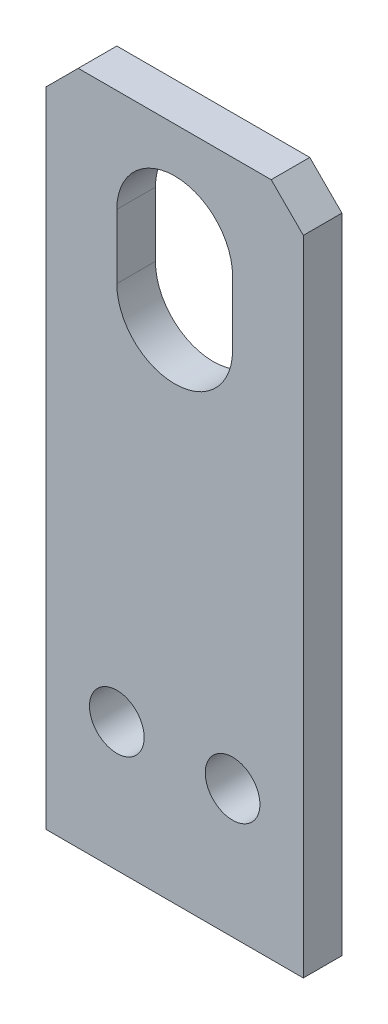
ISO-10303-21;
HEADER;
FILE_DESCRIPTION(('STEP AP214'),'2;1');
FILE_NAME('part.step','',(''),(''),'','','');
FILE_SCHEMA(('AUTOMOTIVE_DESIGN { 1 0 10303 214 1 1 1 1 }'));
ENDSEC;
DATA;
#1=APPLICATION_CONTEXT('core data for automotive mechanical design processes');
#2=APPLICATION_PROTOCOL_DEFINITION('international standard','automotive_design',2000,#1);
#3=PRODUCT_CONTEXT('',#1,'mechanical');
#4=PRODUCT('Part','Part','',(#3));
#5=PRODUCT_RELATED_PRODUCT_CATEGORY('part','',(#4));
#6=PRODUCT_DEFINITION_FORMATION('','',#4);
#7=PRODUCT_DEFINITION_CONTEXT('part definition',#1,'design');
#8=PRODUCT_DEFINITION('design','',#6,#7);
#9=PRODUCT_DEFINITION_SHAPE('','',#8);
#10=(LENGTH_UNIT() NAMED_UNIT(*) SI_UNIT(.MILLI.,.METRE.));
#11=(NAMED_UNIT(*) PLANE_ANGLE_UNIT() SI_UNIT($,.RADIAN.));
#12=(NAMED_UNIT(*) SI_UNIT($,.STERADIAN.) SOLID_ANGLE_UNIT());
#13=UNCERTAINTY_MEASURE_WITH_UNIT(LENGTH_MEASURE(1.E-05),#10,'distance_accuracy_value','');
#14=(GEOMETRIC_REPRESENTATION_CONTEXT(3) GLOBAL_UNCERTAINTY_ASSIGNED_CONTEXT((#13)) GLOBAL_UNIT_ASSIGNED_CONTEXT((#10,
#11,#12)) REPRESENTATION_CONTEXT('',''));
#15=CARTESIAN_POINT('',(0.,0.,0.));
#16=DIRECTION('',(0.,0.,1.));
#17=DIRECTION('',(1.,0.,0.));
#18=AXIS2_PLACEMENT_3D('',#15,#16,#17);
#19=CARTESIAN_POINT('',(0.,0.,3.));
#20=DIRECTION('',(0.,0.,1.));
#21=DIRECTION('',(1.,0.,0.));
#22=AXIS2_PLACEMENT_3D('',#19,#20,#21);
#23=PLANE('',#22);
#24=CARTESIAN_POINT('',(9.,-32.5,3.));
#25=DIRECTION('',(0.,0.,1.));
#26=DIRECTION('',(1.,0.,0.));
#27=AXIS2_PLACEMENT_3D('',#24,#25,#26);
#28=CIRCLE('',#27,4.25);
#29=CARTESIAN_POINT('',(13.25,-32.5,3.));
#30=VERTEX_POINT('',#29);
#31=EDGE_CURVE('E148',#30,#30,#28,.T.);
#32=ORIENTED_EDGE('',*,*,#31,.F.);
#33=EDGE_LOOP('',(#32));
#34=FACE_BOUND('',#33,.T.);
#35=DIRECTION('',(-1.,0.,0.));
#36=VECTOR('',#35,1.);
#37=CARTESIAN_POINT('',(20.,52.5,3.));
#38=LINE('',#37,#36);
#39=CARTESIAN_POINT('',(15.,52.5,3.));
#40=VERTEX_POINT('',#39);
#41=CARTESIAN_POINT('',(-15.,52.5,3.));
#42=VERTEX_POINT('',#41);
#43=EDGE_CURVE('E166',#40,#42,#38,.T.);
#44=ORIENTED_EDGE('',*,*,#43,.T.);
#45=DIRECTION('',(0.707106781186549,0.707106781186547,0.));
#46=VECTOR('',#45,1.);
#47=CARTESIAN_POINT('',(-33.75,33.7500000000001,3.));
#48=LINE('',#47,#46);
#49=CARTESIAN_POINT('',(-20.,47.5,3.));
#50=VERTEX_POINT('',#49);
#51=EDGE_CURVE('E43',#42,#50,#48,.F.);
#52=ORIENTED_EDGE('',*,*,#51,.T.);
#53=DIRECTION('',(0.,-1.,0.));
#54=VECTOR('',#53,1.);
#55=CARTESIAN_POINT('',(-20.,-52.5,3.));
#56=LINE('',#55,#54);
#57=CARTESIAN_POINT('',(-20.,-52.5,3.));
#58=VERTEX_POINT('',#57);
#59=EDGE_CURVE('E159',#50,#58,#56,.T.);
#60=ORIENTED_EDGE('',*,*,#59,.T.);
#61=DIRECTION('',(1.,0.,0.));
#62=VECTOR('',#61,1.);
#63=CARTESIAN_POINT('',(20.,-52.5,3.));
#64=LINE('',#63,#62);
#65=CARTESIAN_POINT('',(20.,-52.5,3.));
#66=VERTEX_POINT('',#65);
#67=EDGE_CURVE('E161',#58,#66,#64,.T.);
#68=ORIENTED_EDGE('',*,*,#67,.T.);
#69=DIRECTION('',(0.,1.,0.));
#70=VECTOR('',#69,1.);
#71=CARTESIAN_POINT('',(20.,-52.5,3.));
#72=LINE('',#71,#70);
#73=CARTESIAN_POINT('',(20.,47.5,3.));
#74=VERTEX_POINT('',#73);
#75=EDGE_CURVE('E164',#66,#74,#72,.T.);
#76=ORIENTED_EDGE('',*,*,#75,.T.);
#77=DIRECTION('',(0.707106781186547,-0.707106781186548,0.));
#78=VECTOR('',#77,1.);
#79=CARTESIAN_POINT('',(33.75,33.75,3.));
#80=LINE('',#79,#78);
#81=EDGE_CURVE('E191',#74,#40,#80,.F.);
#82=ORIENTED_EDGE('',*,*,#81,.T.);
#83=EDGE_LOOP('',(#44,#52,#60,#68,#76,#82));
#84=FACE_BOUND('',#83,.T.);
#85=DIRECTION('',(0.,-1.,0.));
#86=VECTOR('',#85,1.);
#87=CARTESIAN_POINT('',(-9.,36.5,3.));
#88=LINE('',#87,#86);
#89=CARTESIAN_POINT('',(-9.,36.5,3.));
#90=VERTEX_POINT('',#89);
#91=CARTESIAN_POINT('',(-8.99999999999999,26.5,3.));
#92=VERTEX_POINT('',#91);
#93=EDGE_CURVE('E125',#90,#92,#88,.T.);
#94=ORIENTED_EDGE('',*,*,#93,.F.);
#95=CARTESIAN_POINT('',(0.,36.5,3.));
#96=DIRECTION('',(0.,0.,1.));
#97=DIRECTION('',(1.,0.,0.));
#98=AXIS2_PLACEMENT_3D('',#95,#96,#97);
#99=CIRCLE('',#98,9.);
#100=CARTESIAN_POINT('',(9.,36.5,3.));
#101=VERTEX_POINT('',#100);
#102=EDGE_CURVE('E115',#101,#90,#99,.T.);
#103=ORIENTED_EDGE('',*,*,#102,.F.);
#104=DIRECTION('',(0.,1.,0.));
#105=VECTOR('',#104,1.);
#106=CARTESIAN_POINT('',(9.,36.5,3.));
#107=LINE('',#106,#105);
#108=CARTESIAN_POINT('',(8.99999999999999,26.5,3.));
#109=VERTEX_POINT('',#108);
#110=EDGE_CURVE('E141',#109,#101,#107,.T.);
#111=ORIENTED_EDGE('',*,*,#110,.F.);
#112=CARTESIAN_POINT('',(0.,26.5,3.));
#113=DIRECTION('',(0.,0.,1.));
#114=DIRECTION('',(1.,0.,0.));
#115=AXIS2_PLACEMENT_3D('',#112,#113,#114);
#116=CIRCLE('',#115,8.99999999999999);
#117=EDGE_CURVE('E139',#92,#109,#116,.T.);
#118=ORIENTED_EDGE('',*,*,#117,.F.);
#119=EDGE_LOOP('',(#94,#103,#111,#118));
#120=FACE_BOUND('',#119,.T.);
#121=CARTESIAN_POINT('',(-9.,-32.5,3.));
#122=DIRECTION('',(0.,0.,1.));
#123=DIRECTION('',(-1.,0.,0.));
#124=AXIS2_PLACEMENT_3D('',#121,#122,#123);
#125=CIRCLE('',#124,4.25);
#126=CARTESIAN_POINT('',(-13.25,-32.5,3.));
#127=VERTEX_POINT('',#126);
#128=EDGE_CURVE('E267',#127,#127,#125,.T.);
#129=ORIENTED_EDGE('',*,*,#128,.F.);
#130=EDGE_LOOP('',(#129));
#131=FACE_BOUND('',#130,.T.);
#132=ADVANCED_FACE('F34',(#34,#84,#120,#131),#23,.T.);
#133=CARTESIAN_POINT('',(0.,0.,-3.));
#134=DIRECTION('',(0.,0.,1.));
#135=DIRECTION('',(1.,0.,0.));
#136=AXIS2_PLACEMENT_3D('',#133,#134,#135);
#137=PLANE('',#136);
#138=DIRECTION('',(0.,-1.,0.));
#139=VECTOR('',#138,1.);
#140=CARTESIAN_POINT('',(-20.,-52.5,-3.));
#141=LINE('',#140,#139);
#142=CARTESIAN_POINT('',(-20.,47.5,-3.));
#143=VERTEX_POINT('',#142);
#144=CARTESIAN_POINT('',(-20.,-52.5,-3.));
#145=VERTEX_POINT('',#144);
#146=EDGE_CURVE('E133',#143,#145,#141,.T.);
#147=ORIENTED_EDGE('',*,*,#146,.F.);
#148=DIRECTION('',(-0.707106781186549,-0.707106781186547,0.));
#149=VECTOR('',#148,1.);
#150=CARTESIAN_POINT('',(-20.,47.5,-3.));
#151=LINE('',#150,#149);
#152=CARTESIAN_POINT('',(-15.,52.5,-3.));
#153=VERTEX_POINT('',#152);
#154=EDGE_CURVE('E185',#143,#153,#151,.F.);
#155=ORIENTED_EDGE('',*,*,#154,.T.);
#156=DIRECTION('',(-1.,0.,0.));
#157=VECTOR('',#156,1.);
#158=CARTESIAN_POINT('',(20.,52.5,-3.));
#159=LINE('',#158,#157);
#160=CARTESIAN_POINT('',(15.,52.5,-3.));
#161=VERTEX_POINT('',#160);
#162=EDGE_CURVE('E162',#161,#153,#159,.T.);
#163=ORIENTED_EDGE('',*,*,#162,.F.);
#164=DIRECTION('',(-0.707106781186547,0.707106781186548,0.));
#165=VECTOR('',#164,1.);
#166=CARTESIAN_POINT('',(15.,52.5,-3.));
#167=LINE('',#166,#165);
#168=CARTESIAN_POINT('',(20.,47.5,-3.));
#169=VERTEX_POINT('',#168);
#170=EDGE_CURVE('E183',#161,#169,#167,.F.);
#171=ORIENTED_EDGE('',*,*,#170,.T.);
#172=DIRECTION('',(0.,1.,0.));
#173=VECTOR('',#172,1.);
#174=CARTESIAN_POINT('',(20.,-52.5,-3.));
#175=LINE('',#174,#173);
#176=CARTESIAN_POINT('',(20.,-52.5,-3.));
#177=VERTEX_POINT('',#176);
#178=EDGE_CURVE('E172',#177,#169,#175,.T.);
#179=ORIENTED_EDGE('',*,*,#178,.F.);
#180=DIRECTION('',(1.,0.,0.));
#181=VECTOR('',#180,1.);
#182=CARTESIAN_POINT('',(20.,-52.5,-3.));
#183=LINE('',#182,#181);
#184=EDGE_CURVE('E170',#145,#177,#183,.T.);
#185=ORIENTED_EDGE('',*,*,#184,.F.);
#186=EDGE_LOOP('',(#147,#155,#163,#171,#179,#185));
#187=FACE_BOUND('',#186,.T.);
#188=CARTESIAN_POINT('',(0.,36.5,-3.));
#189=DIRECTION('',(0.,0.,1.));
#190=DIRECTION('',(1.,0.,0.));
#191=AXIS2_PLACEMENT_3D('',#188,#189,#190);
#192=CIRCLE('',#191,9.);
#193=CARTESIAN_POINT('',(9.,36.5,-3.));
#194=VERTEX_POINT('',#193);
#195=CARTESIAN_POINT('',(-9.,36.5,-3.));
#196=VERTEX_POINT('',#195);
#197=EDGE_CURVE('E146',#194,#196,#192,.T.);
#198=ORIENTED_EDGE('',*,*,#197,.T.);
#199=DIRECTION('',(0.,-1.,0.));
#200=VECTOR('',#199,1.);
#201=CARTESIAN_POINT('',(-9.,36.5,-3.));
#202=LINE('',#201,#200);
#203=CARTESIAN_POINT('',(-8.99999999999999,26.5,-3.));
#204=VERTEX_POINT('',#203);
#205=EDGE_CURVE('E132',#196,#204,#202,.T.);
#206=ORIENTED_EDGE('',*,*,#205,.T.);
#207=CARTESIAN_POINT('',(0.,26.5,-3.));
#208=DIRECTION('',(0.,0.,1.));
#209=DIRECTION('',(1.,0.,0.));
#210=AXIS2_PLACEMENT_3D('',#207,#208,#209);
#211=CIRCLE('',#210,8.99999999999999);
#212=CARTESIAN_POINT('',(8.99999999999999,26.5,-3.));
#213=VERTEX_POINT('',#212);
#214=EDGE_CURVE('E150',#204,#213,#211,.T.);
#215=ORIENTED_EDGE('',*,*,#214,.T.);
#216=DIRECTION('',(0.,1.,0.));
#217=VECTOR('',#216,1.);
#218=CARTESIAN_POINT('',(9.,36.5,-3.));
#219=LINE('',#218,#217);
#220=EDGE_CURVE('E126',#213,#194,#219,.T.);
#221=ORIENTED_EDGE('',*,*,#220,.T.);
#222=EDGE_LOOP('',(#198,#206,#215,#221));
#223=FACE_BOUND('',#222,.T.);
#224=CARTESIAN_POINT('',(9.,-32.5,-3.));
#225=DIRECTION('',(0.,0.,1.));
#226=DIRECTION('',(1.,0.,0.));
#227=AXIS2_PLACEMENT_3D('',#224,#225,#226);
#228=CIRCLE('',#227,4.25);
#229=CARTESIAN_POINT('',(13.25,-32.5,-3.));
#230=VERTEX_POINT('',#229);
#231=EDGE_CURVE('E273',#230,#230,#228,.T.);
#232=ORIENTED_EDGE('',*,*,#231,.T.);
#233=EDGE_LOOP('',(#232));
#234=FACE_BOUND('',#233,.T.);
#235=CARTESIAN_POINT('',(-9.,-32.5,-3.));
#236=DIRECTION('',(0.,0.,1.));
#237=DIRECTION('',(-1.,0.,0.));
#238=AXIS2_PLACEMENT_3D('',#235,#236,#237);
#239=CIRCLE('',#238,4.25);
#240=CARTESIAN_POINT('',(-13.25,-32.5,-3.));
#241=VERTEX_POINT('',#240);
#242=EDGE_CURVE('E270',#241,#241,#239,.T.);
#243=ORIENTED_EDGE('',*,*,#242,.T.);
#244=EDGE_LOOP('',(#243));
#245=FACE_BOUND('',#244,.T.);
#246=ADVANCED_FACE('F205',(#187,#223,#234,#245),#137,.F.);
#247=CARTESIAN_POINT('',(-20.,-52.5,3.));
#248=DIRECTION('',(1.,0.,0.));
#249=DIRECTION('',(0.,0.,-1.));
#250=AXIS2_PLACEMENT_3D('',#247,#248,#249);
#251=PLANE('',#250);
#252=ORIENTED_EDGE('',*,*,#59,.F.);
#253=DIRECTION('',(0.,0.,-1.));
#254=VECTOR('',#253,1.);
#255=CARTESIAN_POINT('',(-20.,47.5,3.));
#256=LINE('',#255,#254);
#257=EDGE_CURVE('E180',#50,#143,#256,.T.);
#258=ORIENTED_EDGE('',*,*,#257,.T.);
#259=ORIENTED_EDGE('',*,*,#146,.T.);
#260=DIRECTION('',(0.,0.,-1.));
#261=VECTOR('',#260,1.);
#262=CARTESIAN_POINT('',(-20.,-52.5,3.));
#263=LINE('',#262,#261);
#264=EDGE_CURVE('E177',#58,#145,#263,.T.);
#265=ORIENTED_EDGE('',*,*,#264,.F.);
#266=EDGE_LOOP('',(#252,#258,#259,#265));
#267=FACE_BOUND('',#266,.T.);
#268=ADVANCED_FACE('F200',(#267),#251,.F.);
#269=CARTESIAN_POINT('',(20.,-52.5,3.));
#270=DIRECTION('',(0.,1.,0.));
#271=DIRECTION('',(-1.,0.,0.));
#272=AXIS2_PLACEMENT_3D('',#269,#270,#271);
#273=PLANE('',#272);
#274=ORIENTED_EDGE('',*,*,#184,.T.);
#275=DIRECTION('',(0.,0.,-1.));
#276=VECTOR('',#275,1.);
#277=CARTESIAN_POINT('',(20.,-52.5,3.));
#278=LINE('',#277,#276);
#279=EDGE_CURVE('E168',#66,#177,#278,.T.);
#280=ORIENTED_EDGE('',*,*,#279,.F.);
#281=ORIENTED_EDGE('',*,*,#67,.F.);
#282=ORIENTED_EDGE('',*,*,#264,.T.);
#283=EDGE_LOOP('',(#274,#280,#281,#282));
#284=FACE_BOUND('',#283,.T.);
#285=ADVANCED_FACE('F216',(#284),#273,.F.);
#286=CARTESIAN_POINT('',(20.,-52.5,3.));
#287=DIRECTION('',(-1.,0.,0.));
#288=DIRECTION('',(0.,0.,1.));
#289=AXIS2_PLACEMENT_3D('',#286,#287,#288);
#290=PLANE('',#289);
#291=ORIENTED_EDGE('',*,*,#178,.T.);
#292=DIRECTION('',(0.,0.,1.));
#293=VECTOR('',#292,1.);
#294=CARTESIAN_POINT('',(20.,47.5,3.));
#295=LINE('',#294,#293);
#296=EDGE_CURVE('E11',#169,#74,#295,.T.);
#297=ORIENTED_EDGE('',*,*,#296,.T.);
#298=ORIENTED_EDGE('',*,*,#75,.F.);
#299=ORIENTED_EDGE('',*,*,#279,.T.);
#300=EDGE_LOOP('',(#291,#297,#298,#299));
#301=FACE_BOUND('',#300,.T.);
#302=ADVANCED_FACE('F213',(#301),#290,.F.);
#303=CARTESIAN_POINT('',(20.,52.5,3.));
#304=DIRECTION('',(0.,-1.,0.));
#305=DIRECTION('',(0.,0.,-1.));
#306=AXIS2_PLACEMENT_3D('',#303,#304,#305);
#307=PLANE('',#306);
#308=ORIENTED_EDGE('',*,*,#162,.T.);
#309=DIRECTION('',(0.,0.,1.));
#310=VECTOR('',#309,1.);
#311=CARTESIAN_POINT('',(-15.,52.5,3.));
#312=LINE('',#311,#310);
#313=EDGE_CURVE('E56',#153,#42,#312,.T.);
#314=ORIENTED_EDGE('',*,*,#313,.T.);
#315=ORIENTED_EDGE('',*,*,#43,.F.);
#316=DIRECTION('',(0.,0.,-1.));
#317=VECTOR('',#316,1.);
#318=CARTESIAN_POINT('',(15.,52.5,3.));
#319=LINE('',#318,#317);
#320=EDGE_CURVE('E187',#40,#161,#319,.T.);
#321=ORIENTED_EDGE('',*,*,#320,.T.);
#322=EDGE_LOOP('',(#308,#314,#315,#321));
#323=FACE_BOUND('',#322,.T.);
#324=ADVANCED_FACE('F208',(#323),#307,.F.);
#325=CARTESIAN_POINT('',(0.,36.5,3.));
#326=DIRECTION('',(0.,0.,-1.));
#327=DIRECTION('',(-1.,0.,0.));
#328=AXIS2_PLACEMENT_3D('',#325,#326,#327);
#329=CYLINDRICAL_SURFACE('',#328,9.);
#330=ORIENTED_EDGE('',*,*,#197,.F.);
#331=DIRECTION('',(0.,0.,-1.));
#332=VECTOR('',#331,1.);
#333=CARTESIAN_POINT('',(9.,36.5,3.));
#334=LINE('',#333,#332);
#335=EDGE_CURVE('E121',#101,#194,#334,.T.);
#336=ORIENTED_EDGE('',*,*,#335,.F.);
#337=ORIENTED_EDGE('',*,*,#102,.T.);
#338=DIRECTION('',(0.,0.,-1.));
#339=VECTOR('',#338,1.);
#340=CARTESIAN_POINT('',(-9.,36.5,3.));
#341=LINE('',#340,#339);
#342=EDGE_CURVE('E118',#90,#196,#341,.T.);
#343=ORIENTED_EDGE('',*,*,#342,.T.);
#344=EDGE_LOOP('',(#330,#336,#337,#343));
#345=FACE_BOUND('',#344,.T.);
#346=ADVANCED_FACE('F117',(#345),#329,.F.);
#347=CARTESIAN_POINT('',(-9.,36.5,3.));
#348=DIRECTION('',(1.,0.,0.));
#349=DIRECTION('',(0.,1.,0.));
#350=AXIS2_PLACEMENT_3D('',#347,#348,#349);
#351=PLANE('',#350);
#352=ORIENTED_EDGE('',*,*,#205,.F.);
#353=ORIENTED_EDGE('',*,*,#342,.F.);
#354=ORIENTED_EDGE('',*,*,#93,.T.);
#355=DIRECTION('',(0.,0.,-1.));
#356=VECTOR('',#355,1.);
#357=CARTESIAN_POINT('',(-8.99999999999999,26.5,3.));
#358=LINE('',#357,#356);
#359=EDGE_CURVE('E134',#92,#204,#358,.T.);
#360=ORIENTED_EDGE('',*,*,#359,.T.);
#361=EDGE_LOOP('',(#352,#353,#354,#360));
#362=FACE_BOUND('',#361,.T.);
#363=ADVANCED_FACE('F129',(#362),#351,.T.);
#364=CARTESIAN_POINT('',(0.,26.5,3.));
#365=DIRECTION('',(0.,0.,-1.));
#366=DIRECTION('',(-1.,0.,0.));
#367=AXIS2_PLACEMENT_3D('',#364,#365,#366);
#368=CYLINDRICAL_SURFACE('',#367,8.99999999999999);
#369=ORIENTED_EDGE('',*,*,#214,.F.);
#370=ORIENTED_EDGE('',*,*,#359,.F.);
#371=ORIENTED_EDGE('',*,*,#117,.T.);
#372=DIRECTION('',(0.,0.,-1.));
#373=VECTOR('',#372,1.);
#374=CARTESIAN_POINT('',(8.99999999999999,26.5,3.));
#375=LINE('',#374,#373);
#376=EDGE_CURVE('E156',#109,#213,#375,.T.);
#377=ORIENTED_EDGE('',*,*,#376,.T.);
#378=EDGE_LOOP('',(#369,#370,#371,#377));
#379=FACE_BOUND('',#378,.T.);
#380=ADVANCED_FACE('F243',(#379),#368,.F.);
#381=CARTESIAN_POINT('',(9.,36.5,3.));
#382=DIRECTION('',(-1.,0.,0.));
#383=DIRECTION('',(0.,-1.,0.));
#384=AXIS2_PLACEMENT_3D('',#381,#382,#383);
#385=PLANE('',#384);
#386=ORIENTED_EDGE('',*,*,#220,.F.);
#387=ORIENTED_EDGE('',*,*,#376,.F.);
#388=ORIENTED_EDGE('',*,*,#110,.T.);
#389=ORIENTED_EDGE('',*,*,#335,.T.);
#390=EDGE_LOOP('',(#386,#387,#388,#389));
#391=FACE_BOUND('',#390,.T.);
#392=ADVANCED_FACE('F247',(#391),#385,.T.);
#393=CARTESIAN_POINT('',(9.,-32.5,3.));
#394=DIRECTION('',(0.,0.,-1.));
#395=DIRECTION('',(-1.,0.,0.));
#396=AXIS2_PLACEMENT_3D('',#393,#394,#395);
#397=CYLINDRICAL_SURFACE('',#396,4.25);
#398=ORIENTED_EDGE('',*,*,#31,.T.);
#399=EDGE_LOOP('',(#398));
#400=FACE_BOUND('',#399,.T.);
#401=ORIENTED_EDGE('',*,*,#231,.F.);
#402=EDGE_LOOP('',(#401));
#403=FACE_BOUND('',#402,.T.);
#404=ADVANCED_FACE('F253',(#400,#403),#397,.F.);
#405=CARTESIAN_POINT('',(-9.,-32.5,3.));
#406=DIRECTION('',(0.,0.,-1.));
#407=DIRECTION('',(-1.,0.,0.));
#408=AXIS2_PLACEMENT_3D('',#405,#406,#407);
#409=CYLINDRICAL_SURFACE('',#408,4.25);
#410=ORIENTED_EDGE('',*,*,#128,.T.);
#411=EDGE_LOOP('',(#410));
#412=FACE_BOUND('',#411,.T.);
#413=ORIENTED_EDGE('',*,*,#242,.F.);
#414=EDGE_LOOP('',(#413));
#415=FACE_BOUND('',#414,.T.);
#416=ADVANCED_FACE('F257',(#412,#415),#409,.F.);
#417=CARTESIAN_POINT('',(-20.,47.5,3.));
#418=DIRECTION('',(0.707106781186546,-0.707106781186548,0.));
#419=DIRECTION('',(0.,0.,-1.));
#420=AXIS2_PLACEMENT_3D('',#417,#418,#419);
#421=PLANE('',#420);
#422=ORIENTED_EDGE('',*,*,#51,.F.);
#423=ORIENTED_EDGE('',*,*,#313,.F.);
#424=ORIENTED_EDGE('',*,*,#154,.F.);
#425=ORIENTED_EDGE('',*,*,#257,.F.);
#426=EDGE_LOOP('',(#422,#423,#424,#425));
#427=FACE_BOUND('',#426,.T.);
#428=ADVANCED_FACE('F202',(#427),#421,.F.);
#429=CARTESIAN_POINT('',(15.,52.5,3.));
#430=DIRECTION('',(-0.707106781186548,-0.707106781186547,0.));
#431=DIRECTION('',(0.,0.,-1.));
#432=AXIS2_PLACEMENT_3D('',#429,#430,#431);
#433=PLANE('',#432);
#434=ORIENTED_EDGE('',*,*,#81,.F.);
#435=ORIENTED_EDGE('',*,*,#296,.F.);
#436=ORIENTED_EDGE('',*,*,#170,.F.);
#437=ORIENTED_EDGE('',*,*,#320,.F.);
#438=EDGE_LOOP('',(#434,#435,#436,#437));
#439=FACE_BOUND('',#438,.T.);
#440=ADVANCED_FACE('F37',(#439),#433,.F.);
#441=CLOSED_SHELL('',(#132,#246,#268,#285,#302,#324,#346,#363,#380,#392,#404,#416,#428,#440));
#442=MANIFOLD_SOLID_BREP('B2',#441);
#443=ADVANCED_BREP_SHAPE_REPRESENTATION('',(#18,#442),#14);
#444=SHAPE_DEFINITION_REPRESENTATION(#9,#443);
ENDSEC;
END-ISO-10303-21;
